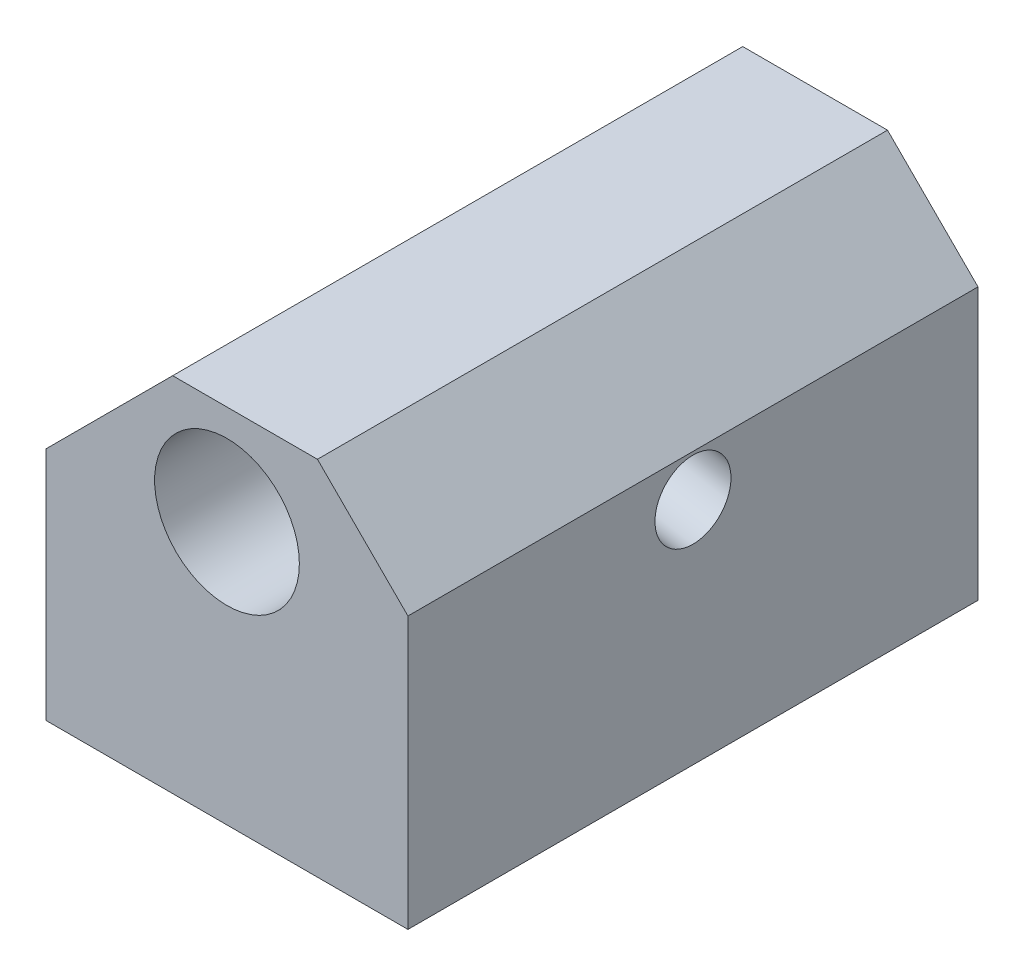
ISO-10303-21;
HEADER;
FILE_DESCRIPTION(('STEP AP214'),'2;1');
FILE_NAME('part.step','',(''),(''),'','','');
FILE_SCHEMA(('AUTOMOTIVE_DESIGN { 1 0 10303 214 1 1 1 1 }'));
ENDSEC;
DATA;
#1=APPLICATION_CONTEXT('core data for automotive mechanical design processes');
#2=APPLICATION_PROTOCOL_DEFINITION('international standard','automotive_design',2000,#1);
#3=PRODUCT_CONTEXT('',#1,'mechanical');
#4=PRODUCT('Part','Part','',(#3));
#5=PRODUCT_RELATED_PRODUCT_CATEGORY('part','',(#4));
#6=PRODUCT_DEFINITION_FORMATION('','',#4);
#7=PRODUCT_DEFINITION_CONTEXT('part definition',#1,'design');
#8=PRODUCT_DEFINITION('design','',#6,#7);
#9=PRODUCT_DEFINITION_SHAPE('','',#8);
#10=(LENGTH_UNIT() NAMED_UNIT(*) SI_UNIT(.MILLI.,.METRE.));
#11=(NAMED_UNIT(*) PLANE_ANGLE_UNIT() SI_UNIT($,.RADIAN.));
#12=(NAMED_UNIT(*) SI_UNIT($,.STERADIAN.) SOLID_ANGLE_UNIT());
#13=UNCERTAINTY_MEASURE_WITH_UNIT(LENGTH_MEASURE(1.E-05),#10,'distance_accuracy_value','');
#14=(GEOMETRIC_REPRESENTATION_CONTEXT(3) GLOBAL_UNCERTAINTY_ASSIGNED_CONTEXT((#13)) GLOBAL_UNIT_ASSIGNED_CONTEXT((#10,
#11,#12)) REPRESENTATION_CONTEXT('',''));
#15=CARTESIAN_POINT('',(0.,0.,0.));
#16=DIRECTION('',(0.,0.,1.));
#17=DIRECTION('',(1.,0.,0.));
#18=AXIS2_PLACEMENT_3D('',#15,#16,#17);
#19=CARTESIAN_POINT('',(0.,0.,15.75));
#20=DIRECTION('',(0.,0.,-1.));
#21=DIRECTION('',(-1.,0.,0.));
#22=AXIS2_PLACEMENT_3D('',#19,#20,#21);
#23=PLANE('',#22);
#24=DIRECTION('',(-0.707106781186551,-0.707106781186544,0.));
#25=VECTOR('',#24,1.);
#26=CARTESIAN_POINT('',(-2.99999999999993,10.,15.75));
#27=LINE('',#26,#25);
#28=CARTESIAN_POINT('',(-2.99999999999993,10.,15.75));
#29=VERTEX_POINT('',#28);
#30=CARTESIAN_POINT('',(-10.,3.,15.75));
#31=VERTEX_POINT('',#30);
#32=EDGE_CURVE('E151',#29,#31,#27,.T.);
#33=ORIENTED_EDGE('',*,*,#32,.T.);
#34=DIRECTION('',(0.,-1.,0.));
#35=VECTOR('',#34,1.);
#36=CARTESIAN_POINT('',(-10.,3.,15.75));
#37=LINE('',#36,#35);
#38=CARTESIAN_POINT('',(-10.,-10.,15.75));
#39=VERTEX_POINT('',#38);
#40=EDGE_CURVE('E102',#31,#39,#37,.T.);
#41=ORIENTED_EDGE('',*,*,#40,.T.);
#42=DIRECTION('',(1.,0.,0.));
#43=VECTOR('',#42,1.);
#44=CARTESIAN_POINT('',(10.,-10.,15.75));
#45=LINE('',#44,#43);
#46=CARTESIAN_POINT('',(10.,-10.,15.75));
#47=VERTEX_POINT('',#46);
#48=EDGE_CURVE('E118',#39,#47,#45,.T.);
#49=ORIENTED_EDGE('',*,*,#48,.T.);
#50=DIRECTION('',(0.,1.,0.));
#51=VECTOR('',#50,1.);
#52=CARTESIAN_POINT('',(10.,5.,15.75));
#53=LINE('',#52,#51);
#54=CARTESIAN_POINT('',(10.,5.,15.75));
#55=VERTEX_POINT('',#54);
#56=EDGE_CURVE('E111',#47,#55,#53,.T.);
#57=ORIENTED_EDGE('',*,*,#56,.T.);
#58=DIRECTION('',(-0.707106781186544,0.707106781186551,0.));
#59=VECTOR('',#58,1.);
#60=CARTESIAN_POINT('',(10.,5.,15.75));
#61=LINE('',#60,#59);
#62=CARTESIAN_POINT('',(5.00000000000006,10.,15.75));
#63=VERTEX_POINT('',#62);
#64=EDGE_CURVE('E115',#55,#63,#61,.T.);
#65=ORIENTED_EDGE('',*,*,#64,.T.);
#66=DIRECTION('',(-1.,0.,0.));
#67=VECTOR('',#66,1.);
#68=CARTESIAN_POINT('',(5.00000000000006,10.,15.75));
#69=LINE('',#68,#67);
#70=EDGE_CURVE('E66',#63,#29,#69,.T.);
#71=ORIENTED_EDGE('',*,*,#70,.T.);
#72=EDGE_LOOP('',(#33,#41,#49,#57,#65,#71));
#73=FACE_BOUND('',#72,.T.);
#74=CARTESIAN_POINT('',(0.,4.5,15.75));
#75=DIRECTION('',(0.,0.,1.));
#76=DIRECTION('',(1.,0.,0.));
#77=AXIS2_PLACEMENT_3D('',#74,#75,#76);
#78=CIRCLE('',#77,4.);
#79=CARTESIAN_POINT('',(4.,4.5,15.75));
#80=VERTEX_POINT('',#79);
#81=EDGE_CURVE('E143',#80,#80,#78,.T.);
#82=ORIENTED_EDGE('',*,*,#81,.F.);
#83=EDGE_LOOP('',(#82));
#84=FACE_BOUND('',#83,.T.);
#85=ADVANCED_FACE('F40',(#73,#84),#23,.F.);
#86=CARTESIAN_POINT('',(0.,0.,-15.75));
#87=DIRECTION('',(0.,0.,-1.));
#88=DIRECTION('',(-1.,0.,0.));
#89=AXIS2_PLACEMENT_3D('',#86,#87,#88);
#90=PLANE('',#89);
#91=DIRECTION('',(-0.707106781186551,-0.707106781186544,0.));
#92=VECTOR('',#91,1.);
#93=CARTESIAN_POINT('',(-2.99999999999993,10.,-15.75));
#94=LINE('',#93,#92);
#95=CARTESIAN_POINT('',(-2.99999999999993,10.,-15.75));
#96=VERTEX_POINT('',#95);
#97=CARTESIAN_POINT('',(-10.,3.,-15.75));
#98=VERTEX_POINT('',#97);
#99=EDGE_CURVE('E139',#96,#98,#94,.T.);
#100=ORIENTED_EDGE('',*,*,#99,.F.);
#101=DIRECTION('',(-1.,0.,0.));
#102=VECTOR('',#101,1.);
#103=CARTESIAN_POINT('',(5.00000000000006,10.,-15.75));
#104=LINE('',#103,#102);
#105=CARTESIAN_POINT('',(5.00000000000006,10.,-15.75));
#106=VERTEX_POINT('',#105);
#107=EDGE_CURVE('E93',#106,#96,#104,.T.);
#108=ORIENTED_EDGE('',*,*,#107,.F.);
#109=DIRECTION('',(-0.707106781186544,0.707106781186551,0.));
#110=VECTOR('',#109,1.);
#111=CARTESIAN_POINT('',(10.,5.,-15.75));
#112=LINE('',#111,#110);
#113=CARTESIAN_POINT('',(10.,5.,-15.75));
#114=VERTEX_POINT('',#113);
#115=EDGE_CURVE('E148',#114,#106,#112,.T.);
#116=ORIENTED_EDGE('',*,*,#115,.F.);
#117=DIRECTION('',(0.,1.,0.));
#118=VECTOR('',#117,1.);
#119=CARTESIAN_POINT('',(10.,5.,-15.75));
#120=LINE('',#119,#118);
#121=CARTESIAN_POINT('',(10.,-10.,-15.75));
#122=VERTEX_POINT('',#121);
#123=EDGE_CURVE('E127',#122,#114,#120,.T.);
#124=ORIENTED_EDGE('',*,*,#123,.F.);
#125=DIRECTION('',(1.,0.,0.));
#126=VECTOR('',#125,1.);
#127=CARTESIAN_POINT('',(10.,-10.,-15.75));
#128=LINE('',#127,#126);
#129=CARTESIAN_POINT('',(-10.,-10.,-15.75));
#130=VERTEX_POINT('',#129);
#131=EDGE_CURVE('E145',#130,#122,#128,.T.);
#132=ORIENTED_EDGE('',*,*,#131,.F.);
#133=DIRECTION('',(0.,-1.,0.));
#134=VECTOR('',#133,1.);
#135=CARTESIAN_POINT('',(-10.,3.,-15.75));
#136=LINE('',#135,#134);
#137=EDGE_CURVE('E142',#98,#130,#136,.T.);
#138=ORIENTED_EDGE('',*,*,#137,.F.);
#139=EDGE_LOOP('',(#100,#108,#116,#124,#132,#138));
#140=FACE_BOUND('',#139,.T.);
#141=CARTESIAN_POINT('',(0.,4.5,-15.75));
#142=DIRECTION('',(0.,0.,1.));
#143=DIRECTION('',(1.,0.,0.));
#144=AXIS2_PLACEMENT_3D('',#141,#142,#143);
#145=CIRCLE('',#144,4.);
#146=CARTESIAN_POINT('',(4.,4.5,-15.75));
#147=VERTEX_POINT('',#146);
#148=EDGE_CURVE('E202',#147,#147,#145,.T.);
#149=ORIENTED_EDGE('',*,*,#148,.T.);
#150=EDGE_LOOP('',(#149));
#151=FACE_BOUND('',#150,.T.);
#152=ADVANCED_FACE('F230',(#140,#151),#90,.T.);
#153=CARTESIAN_POINT('',(-2.99999999999993,10.,15.75));
#154=DIRECTION('',(0.707106781186544,-0.707106781186551,0.));
#155=DIRECTION('',(0.707106781186551,0.707106781186544,0.));
#156=AXIS2_PLACEMENT_3D('',#153,#154,#155);
#157=PLANE('',#156);
#158=ORIENTED_EDGE('',*,*,#99,.T.);
#159=DIRECTION('',(0.,0.,-1.));
#160=VECTOR('',#159,1.);
#161=CARTESIAN_POINT('',(-10.,3.,15.75));
#162=LINE('',#161,#160);
#163=EDGE_CURVE('E158',#31,#98,#162,.T.);
#164=ORIENTED_EDGE('',*,*,#163,.F.);
#165=ORIENTED_EDGE('',*,*,#32,.F.);
#166=DIRECTION('',(0.,0.,-1.));
#167=VECTOR('',#166,1.);
#168=CARTESIAN_POINT('',(-2.99999999999993,10.,15.75));
#169=LINE('',#168,#167);
#170=EDGE_CURVE('E135',#29,#96,#169,.T.);
#171=ORIENTED_EDGE('',*,*,#170,.T.);
#172=EDGE_LOOP('',(#158,#164,#165,#171));
#173=FACE_BOUND('',#172,.T.);
#174=ADVANCED_FACE('F42',(#173),#157,.F.);
#175=CARTESIAN_POINT('',(-10.,3.,15.75));
#176=DIRECTION('',(1.,0.,0.));
#177=DIRECTION('',(0.,1.,0.));
#178=AXIS2_PLACEMENT_3D('',#175,#176,#177);
#179=PLANE('',#178);
#180=ORIENTED_EDGE('',*,*,#137,.T.);
#181=DIRECTION('',(0.,0.,-1.));
#182=VECTOR('',#181,1.);
#183=CARTESIAN_POINT('',(-10.,-10.,15.75));
#184=LINE('',#183,#182);
#185=EDGE_CURVE('E155',#39,#130,#184,.T.);
#186=ORIENTED_EDGE('',*,*,#185,.F.);
#187=ORIENTED_EDGE('',*,*,#40,.F.);
#188=ORIENTED_EDGE('',*,*,#163,.T.);
#189=EDGE_LOOP('',(#180,#186,#187,#188));
#190=FACE_BOUND('',#189,.T.);
#191=ADVANCED_FACE('F224',(#190),#179,.F.);
#192=CARTESIAN_POINT('',(10.,-10.,15.75));
#193=DIRECTION('',(0.,1.,0.));
#194=DIRECTION('',(0.,0.,1.));
#195=AXIS2_PLACEMENT_3D('',#192,#193,#194);
#196=PLANE('',#195);
#197=CARTESIAN_POINT('',(0.,-10.,0.));
#198=DIRECTION('',(0.,-1.,0.));
#199=DIRECTION('',(0.,0.,-1.));
#200=AXIS2_PLACEMENT_3D('',#197,#198,#199);
#201=CIRCLE('',#200,4.25);
#202=CARTESIAN_POINT('',(0.,-10.,-4.25));
#203=VERTEX_POINT('',#202);
#204=EDGE_CURVE('E203',#203,#203,#201,.T.);
#205=ORIENTED_EDGE('',*,*,#204,.F.);
#206=EDGE_LOOP('',(#205));
#207=FACE_BOUND('',#206,.T.);
#208=ORIENTED_EDGE('',*,*,#131,.T.);
#209=DIRECTION('',(0.,0.,-1.));
#210=VECTOR('',#209,1.);
#211=CARTESIAN_POINT('',(10.,-10.,15.75));
#212=LINE('',#211,#210);
#213=EDGE_CURVE('E130',#47,#122,#212,.T.);
#214=ORIENTED_EDGE('',*,*,#213,.F.);
#215=ORIENTED_EDGE('',*,*,#48,.F.);
#216=ORIENTED_EDGE('',*,*,#185,.T.);
#217=EDGE_LOOP('',(#208,#214,#215,#216));
#218=FACE_BOUND('',#217,.T.);
#219=ADVANCED_FACE('F227',(#207,#218),#196,.F.);
#220=CARTESIAN_POINT('',(10.,5.,15.75));
#221=DIRECTION('',(-1.,0.,0.));
#222=DIRECTION('',(0.,-1.,0.));
#223=AXIS2_PLACEMENT_3D('',#220,#221,#222);
#224=PLANE('',#223);
#225=CARTESIAN_POINT('',(10.,2.69283264857183,0.));
#226=DIRECTION('',(-1.,0.,0.));
#227=DIRECTION('',(0.,-1.,0.));
#228=AXIS2_PLACEMENT_3D('',#225,#226,#227);
#229=ELLIPSE('',#228,2.13239588496007,2.1);
#230=CARTESIAN_POINT('',(10.,0.560436763611763,0.));
#231=VERTEX_POINT('',#230);
#232=EDGE_CURVE('E208',#231,#231,#229,.T.);
#233=ORIENTED_EDGE('',*,*,#232,.T.);
#234=EDGE_LOOP('',(#233));
#235=FACE_BOUND('',#234,.T.);
#236=ORIENTED_EDGE('',*,*,#123,.T.);
#237=DIRECTION('',(0.,0.,-1.));
#238=VECTOR('',#237,1.);
#239=CARTESIAN_POINT('',(10.,5.,15.75));
#240=LINE('',#239,#238);
#241=EDGE_CURVE('E124',#55,#114,#240,.T.);
#242=ORIENTED_EDGE('',*,*,#241,.F.);
#243=ORIENTED_EDGE('',*,*,#56,.F.);
#244=ORIENTED_EDGE('',*,*,#213,.T.);
#245=EDGE_LOOP('',(#236,#242,#243,#244));
#246=FACE_BOUND('',#245,.T.);
#247=ADVANCED_FACE('F125',(#235,#246),#224,.F.);
#248=CARTESIAN_POINT('',(10.,5.,15.75));
#249=DIRECTION('',(-0.707106781186551,-0.707106781186544,0.));
#250=DIRECTION('',(0.707106781186544,-0.707106781186551,0.));
#251=AXIS2_PLACEMENT_3D('',#248,#249,#250);
#252=PLANE('',#251);
#253=ORIENTED_EDGE('',*,*,#115,.T.);
#254=DIRECTION('',(0.,0.,-1.));
#255=VECTOR('',#254,1.);
#256=CARTESIAN_POINT('',(5.00000000000006,10.,15.75));
#257=LINE('',#256,#255);
#258=EDGE_CURVE('E131',#63,#106,#257,.T.);
#259=ORIENTED_EDGE('',*,*,#258,.F.);
#260=ORIENTED_EDGE('',*,*,#64,.F.);
#261=ORIENTED_EDGE('',*,*,#241,.T.);
#262=EDGE_LOOP('',(#253,#259,#260,#261));
#263=FACE_BOUND('',#262,.T.);
#264=ADVANCED_FACE('F133',(#263),#252,.F.);
#265=CARTESIAN_POINT('',(5.00000000000006,10.,15.75));
#266=DIRECTION('',(0.,-1.,0.));
#267=DIRECTION('',(1.,0.,0.));
#268=AXIS2_PLACEMENT_3D('',#265,#266,#267);
#269=PLANE('',#268);
#270=ORIENTED_EDGE('',*,*,#107,.T.);
#271=ORIENTED_EDGE('',*,*,#170,.F.);
#272=ORIENTED_EDGE('',*,*,#70,.F.);
#273=ORIENTED_EDGE('',*,*,#258,.T.);
#274=EDGE_LOOP('',(#270,#271,#272,#273));
#275=FACE_BOUND('',#274,.T.);
#276=ADVANCED_FACE('F232',(#275),#269,.F.);
#277=CARTESIAN_POINT('',(0.,4.5,15.75));
#278=DIRECTION('',(0.,0.,-1.));
#279=DIRECTION('',(-1.,0.,0.));
#280=AXIS2_PLACEMENT_3D('',#277,#278,#279);
#281=CYLINDRICAL_SURFACE('',#280,4.);
#282=CARTESIAN_POINT('',(3.73573382421497,5.92978767466228,0.));
#283=CARTESIAN_POINT('',(3.73574388882922,5.92977635725523,-0.10900487248513));
#284=CARTESIAN_POINT('',(3.73933920981242,5.92047562433933,-0.218131042316769));
#285=CARTESIAN_POINT('',(3.75303986475567,5.88385240616574,-0.432980813605728));
#286=CARTESIAN_POINT('',(3.76315734967283,5.85649628098081,-0.53869767663652));
#287=CARTESIAN_POINT('',(3.78798394174231,5.78552290822274,-0.743225340281333));
#288=CARTESIAN_POINT('',(3.80266751129794,5.74199584553236,-0.842070898971087));
#289=CARTESIAN_POINT('',(3.83432873328278,5.64050039960012,-1.03158235918548));
#290=CARTESIAN_POINT('',(3.85130669428291,5.58253007300877,-1.12224715774618));
#291=CARTESIAN_POINT('',(3.88666506630928,5.44819044934738,-1.30160928697176));
#292=CARTESIAN_POINT('',(3.90503753060019,5.37065156023718,-1.38943267267201));
#293=CARTESIAN_POINT('',(3.9387672724276,5.20247469598594,-1.55224901996635));
#294=CARTESIAN_POINT('',(3.95412300572651,5.11183005312481,-1.62723540790363));
#295=CARTESIAN_POINT('',(3.97999990573105,4.91273679803611,-1.7673634284533));
#296=CARTESIAN_POINT('',(3.99010934030686,4.80348748803581,-1.83145411576367));
#297=CARTESIAN_POINT('',(4.0009138638704,4.57539007127553,-1.94052378148518));
#298=CARTESIAN_POINT('',(4.00161568200528,4.45654888668,-1.98551639819159));
#299=CARTESIAN_POINT('',(3.9919619407152,4.22281545469177,-2.05148193373954));
#300=CARTESIAN_POINT('',(3.98246809233367,4.10834290397449,-2.07406009301153));
#301=CARTESIAN_POINT('',(3.95312612574611,3.87857050282372,-2.0999222240196));
#302=CARTESIAN_POINT('',(3.93328457969918,3.76327122326166,-2.10321842613824));
#303=CARTESIAN_POINT('',(3.8861052638642,3.54638842558353,-2.09100911539977));
#304=CARTESIAN_POINT('',(3.85962209562948,3.44451694638769,-2.0772005783596));
#305=CARTESIAN_POINT('',(3.79982004842026,3.24616582917178,-2.03428448793197));
#306=CARTESIAN_POINT('',(3.76650054527618,3.14968668450565,-2.00517553721013));
#307=CARTESIAN_POINT('',(3.694156102428,2.9626489147776,-1.93222637269289));
#308=CARTESIAN_POINT('',(3.65504265012272,2.87222114441992,-1.88814068086587));
#309=CARTESIAN_POINT('',(3.57369366485427,2.70062678739403,-1.78683082634314));
#310=CARTESIAN_POINT('',(3.53145703738273,2.61946347301885,-1.72960204274877));
#311=CARTESIAN_POINT('',(3.44170338226362,2.45942497261562,-1.59680430831566));
#312=CARTESIAN_POINT('',(3.39409499294296,2.38167090077285,-1.51994519803714));
#313=CARTESIAN_POINT('',(3.30110872526266,2.23948824620547,-1.35347241778113));
#314=CARTESIAN_POINT('',(3.25573299232802,2.17507229691932,-1.26384679013622));
#315=CARTESIAN_POINT('',(3.16760712533176,2.05620353076697,-1.06620551177198));
#316=CARTESIAN_POINT('',(3.12530709411419,2.00285600999866,-0.957315836829489));
#317=CARTESIAN_POINT('',(3.05227115275024,1.91408123949603,-0.728881038594662));
#318=CARTESIAN_POINT('',(3.021521057204,1.87863198891366,-0.609349210574807));
#319=CARTESIAN_POINT('',(2.97806517019922,1.82939571742376,-0.373915912940019));
#320=CARTESIAN_POINT('',(2.96401942002301,1.81398891697369,-0.258607203624979));
#321=CARTESIAN_POINT('',(2.951455358101,1.80018170291955,-0.0261777025889804));
#322=CARTESIAN_POINT('',(2.95292276124122,1.801765643601,0.0909413228832848));
#323=CARTESIAN_POINT('',(2.9698859587365,1.82046992711117,0.307152153482557));
#324=CARTESIAN_POINT('',(2.98350890061147,1.83551680588273,0.406586850178257));
#325=CARTESIAN_POINT('',(3.020668976319,1.87772161239194,0.600920219354124));
#326=CARTESIAN_POINT('',(3.04420992937658,1.9048842058825,0.69581712873268));
#327=CARTESIAN_POINT('',(3.10030524386941,1.97213459357223,0.883627217890509));
#328=CARTESIAN_POINT('',(3.13323978736668,2.01278292992207,0.976223608159363));
#329=CARTESIAN_POINT('',(3.20481504670472,2.10571515773543,1.15298164240043));
#330=CARTESIAN_POINT('',(3.24345870541864,2.15800505715592,1.23713889847494));
#331=CARTESIAN_POINT('',(3.32981375287527,2.28214896594857,1.40770296531066));
#332=CARTESIAN_POINT('',(3.37801988223844,2.35575452641615,1.49259140491386));
#333=CARTESIAN_POINT('',(3.47488071800792,2.51656411741067,1.64813613911597));
#334=CARTESIAN_POINT('',(3.5235356352092,2.60377488007912,1.71878534796223));
#335=CARTESIAN_POINT('',(3.61987222101468,2.79459461842828,1.8465432114591));
#336=CARTESIAN_POINT('',(3.66742611166257,2.89874039744041,1.90295440850277));
#337=CARTESIAN_POINT('',(3.75563369323199,3.11827733149894,1.99570241904227));
#338=CARTESIAN_POINT('',(3.79629405935876,3.23365743554907,2.03205873007556));
#339=CARTESIAN_POINT('',(3.86418672560047,3.46044161026922,2.08018253789637));
#340=CARTESIAN_POINT('',(3.89234287138805,3.5711326720768,2.09400545342962));
#341=CARTESIAN_POINT('',(3.9390840835918,3.79523583024272,2.10285214449908));
#342=CARTESIAN_POINT('',(3.95767358924312,3.90864663893275,2.09788464835541));
#343=CARTESIAN_POINT('',(3.98376400965127,4.12509824222281,2.07056684593317));
#344=CARTESIAN_POINT('',(3.99204258939678,4.22823347392377,2.04966041653997));
#345=CARTESIAN_POINT('',(4.00068347945213,4.43069470076948,1.99309022230328));
#346=CARTESIAN_POINT('',(4.00104484383502,4.53002023932747,1.95742469460231));
#347=CARTESIAN_POINT('',(3.99486213031366,4.72587780408664,1.87110898168503));
#348=CARTESIAN_POINT('',(3.98807340051486,4.82218682855579,1.81997349015483));
#349=CARTESIAN_POINT('',(3.9689309548596,5.00611366199099,1.70476947567042));
#350=CARTESIAN_POINT('',(3.9565748505942,5.09372772110339,1.64069540857203));
#351=CARTESIAN_POINT('',(3.92680764719066,5.26728577319698,1.49363061850587));
#352=CARTESIAN_POINT('',(3.90900074119554,5.35207814900283,1.40935727944421));
#353=CARTESIAN_POINT('',(3.87200466880851,5.50694170863506,1.22836684135043));
#354=CARTESIAN_POINT('',(3.85281412396071,5.57699793161271,1.13163725518586));
#355=CARTESIAN_POINT('',(3.81538018344913,5.70309151254874,0.922370907309671));
#356=CARTESIAN_POINT('',(3.79722882566375,5.75827705843025,0.809292849807942));
#357=CARTESIAN_POINT('',(3.77434931765566,5.82469936809198,0.63324869119763));
#358=CARTESIAN_POINT('',(3.76745133012323,5.84410479535718,0.573548335378771));
#359=CARTESIAN_POINT('',(3.75548200773901,5.87719526060027,0.452417996539227));
#360=CARTESIAN_POINT('',(3.75040948659348,5.89088401453505,0.39098916487277));
#361=CARTESIAN_POINT('',(3.74291100002645,5.91092789324483,0.274750482297567));
#362=CARTESIAN_POINT('',(3.74023274376832,5.9179879051628,0.22007773519887));
#363=CARTESIAN_POINT('',(3.73664156841135,5.92742076836415,0.110280357905016));
#364=CARTESIAN_POINT('',(3.73572873159022,5.92979340119147,0.0551557067690171));
#365=CARTESIAN_POINT('',(3.73573382421497,5.92978767466228,0.));
#366=B_SPLINE_CURVE_WITH_KNOTS('',3,(#282,#283,#284,#285,#286,#287,#288,#289,#290,#291,#292,
#293,#294,#295,#296,#297,#298,#299,#300,#301,#302,#303,#304,#305,#306,#307,#308,#309,#310,#311,
#312,#313,#314,#315,#316,#317,#318,#319,#320,#321,#322,#323,#324,#325,#326,#327,#328,#329,#330,
#331,#332,#333,#334,#335,#336,#337,#338,#339,#340,#341,#342,#343,#344,#345,#346,#347,#348,#349,
#350,#351,#352,#353,#354,#355,#356,#357,#358,#359,#360,#361,#362,#363,#364,#365),.UNSPECIFIED.,
.T.,.F.,(4,2,2,2,2,2,2,2,2,2,2,2,2,2,2,2,2,2,2,2,2,2,2,2,2,2,2,2,2,2,2,2,2,2,2,2,2,2,2,2,2,4),
(0.,0.326791523596936,0.654193634528532,0.979796591858559,1.30544338293594,1.65972345746273,
2.01418441493588,2.39335959943495,2.77226355031262,3.12149166757548,3.47049824835422,
3.78748987929336,4.10451046502358,4.42700024421397,4.7496035796477,5.10584652082891,
5.46242535572385,5.84566981000256,6.22844201993997,6.57782700869907,6.92689029823773,
7.22998530854011,7.5331971414191,7.8510429895248,8.16905325275698,8.53424010139829,
8.89960822874656,9.28039922364491,9.66081935474374,10.0040697601162,10.3471607420823,
10.6623995301666,10.977675981902,11.3041016838807,11.6306675563245,11.9916903212788,
12.3530778634201,12.7321159612543,12.9213211927067,13.1104032446597,13.275749775207,
13.4411040115744),.UNSPECIFIED.);
#367=CARTESIAN_POINT('',(3.75419889698741,3.11942380077792,1.99210708594154));
#368=VERTEX_POINT('',#367);
#369=CARTESIAN_POINT('',(3.75419889698742,3.11942380077792,-1.99210708594154));
#370=VERTEX_POINT('',#369);
#371=EDGE_CURVE('E11',#368,#370,#366,.T.);
#372=ORIENTED_EDGE('',*,*,#371,.F.);
#373=CARTESIAN_POINT('',(-3.96862696659689,5.,1.52069063257455));
#374=CARTESIAN_POINT('',(-3.97354304586204,4.96097381810533,1.50786136152258));
#375=CARTESIAN_POINT('',(-3.977932886008,4.92148596438851,1.49621923641095));
#376=CARTESIAN_POINT('',(-3.98558676219901,4.84163580315582,1.47570855649782));
#377=CARTESIAN_POINT('',(-3.98884924334194,4.80127236885029,1.46684383396861));
#378=CARTESIAN_POINT('',(-3.99676875368411,4.67984636740227,1.44519732127154));
#379=CARTESIAN_POINT('',(-3.99965011887754,4.5977331499862,1.43711480112112));
#380=CARTESIAN_POINT('',(-4.00029181299223,4.43275423673456,1.43532825301997));
#381=CARTESIAN_POINT('',(-3.99801510797099,4.34988738089606,1.44172820602381));
#382=CARTESIAN_POINT('',(-3.98854747270871,4.18662780570009,1.46770784412369));
#383=CARTESIAN_POINT('',(-3.98135389875695,4.10623644168292,1.48729461944842));
#384=CARTESIAN_POINT('',(-3.95720348824089,3.90306012274173,1.55071483260326));
#385=CARTESIAN_POINT('',(-3.93699424981176,3.78309244667518,1.60203211253694));
#386=CARTESIAN_POINT('',(-3.88772763163925,3.55145605268259,1.71816787082274));
#387=CARTESIAN_POINT('',(-3.85861468469421,3.43984509514413,1.78307030625666));
#388=CARTESIAN_POINT('',(-3.78878199865306,3.2112234195852,1.92737435010536));
#389=CARTESIAN_POINT('',(-3.74712433070059,3.09502024660309,2.00758568017899));
#390=CARTESIAN_POINT('',(-3.65444569719787,2.86906784578287,2.17173976787611));
#391=CARTESIAN_POINT('',(-3.6034151909188,2.75932534603108,2.25568626098704));
#392=CARTESIAN_POINT('',(-3.49205846568342,2.54550840564099,2.42451176720586));
#393=CARTESIAN_POINT('',(-3.43173624880684,2.44143155072153,2.50939036429385));
#394=CARTESIAN_POINT('',(-3.30165189473649,2.23867445568565,2.67823761984924));
#395=CARTESIAN_POINT('',(-3.23189442400748,2.13999158149155,2.76220670610606));
#396=CARTESIAN_POINT('',(-3.08962668997358,1.95710092956709,2.92008857269301));
#397=CARTESIAN_POINT('',(-3.01798145579123,1.87240188962165,2.99420832194827));
#398=CARTESIAN_POINT('',(-2.86652944700425,1.70795500053687,3.13951252599785));
#399=CARTESIAN_POINT('',(-2.78672155041677,1.62820783447532,3.21069657537925));
#400=CARTESIAN_POINT('',(-2.53503024251524,1.39753094104462,3.41807639266074));
#401=CARTESIAN_POINT('',(-2.35049335092218,1.25466047324422,3.54854244100856));
#402=CARTESIAN_POINT('',(-2.00018050647842,1.03150876793698,3.75387669272813));
#403=CARTESIAN_POINT('',(-1.84196375858493,0.944606694526363,3.83438677769595));
#404=CARTESIAN_POINT('',(-1.59194860411325,0.829285838446407,3.94162948021151));
#405=CARTESIAN_POINT('',(-1.50646609770759,0.79334191885586,3.97513178567251));
#406=CARTESIAN_POINT('',(-1.33161898939826,0.727000799786437,4.03706348445111));
#407=CARTESIAN_POINT('',(-1.24225611464601,0.696601163253273,4.06549510652463));
#408=CARTESIAN_POINT('',(-1.05920763113708,0.641593206094736,4.11700240412601));
#409=CARTESIAN_POINT('',(-0.965487797007023,0.617045672995296,4.14002183033811));
#410=CARTESIAN_POINT('',(-0.775290718903061,0.574645280586653,4.17981531737301));
#411=CARTESIAN_POINT('',(-0.678814988023234,0.556788820860285,4.19659273693881));
#412=CARTESIAN_POINT('',(-0.483953068228635,0.528164086671947,4.223500521622));
#413=CARTESIAN_POINT('',(-0.385567990157397,0.517391810855141,4.23363463906094));
#414=CARTESIAN_POINT('',(-0.1878105215711,0.503182327401976,4.24700431582164));
#415=CARTESIAN_POINT('',(-0.0884382842245292,0.499743999146154,4.2502409290747));
#416=CARTESIAN_POINT('',(0.0960823380158941,0.500247106315385,4.24976744042028));
#417=CARTESIAN_POINT('',(0.181237731559154,0.503205832175325,4.24698238117385));
#418=CARTESIAN_POINT('',(0.350879177096289,0.514510559449824,4.23634548027923));
#419=CARTESIAN_POINT('',(0.435365015611604,0.522858214217112,4.22849208363774));
#420=CARTESIAN_POINT('',(0.686812573375991,0.555793695328166,4.19752338346075));
#421=CARTESIAN_POINT('',(0.85193878092647,0.588274924137043,4.16699870271484));
#422=CARTESIAN_POINT('',(1.17045661137207,0.671575220511052,4.08890340963282));
#423=CARTESIAN_POINT('',(1.32397993432288,0.722131785382384,4.04157687132378));
#424=CARTESIAN_POINT('',(1.61938662043091,0.839011223129891,3.93254335188154));
#425=CARTESIAN_POINT('',(1.76126698197661,0.905338144610415,3.8708326780982));
#426=CARTESIAN_POINT('',(2.09566906535834,1.08543517663311,3.70406548510811));
#427=CARTESIAN_POINT('',(2.28070432446411,1.20686158523893,3.59225884484247));
#428=CARTESIAN_POINT('',(2.62210615430781,1.47155232097672,3.35125974420092));
#429=CARTESIAN_POINT('',(2.77837809562941,1.61488598761558,3.22201223880083));
#430=CARTESIAN_POINT('',(3.01399570331329,1.86664727253549,2.99915090570319));
#431=CARTESIAN_POINT('',(3.10138923990572,1.97028434245371,2.90843719125072));
#432=CARTESIAN_POINT('',(3.26434983168532,2.18437087173977,2.72426784831242));
#433=CARTESIAN_POINT('',(3.33990953941884,2.29482450455707,2.63081055879932));
#434=CARTESIAN_POINT('',(3.47929116854544,2.5220544418376,2.44348759692863));
#435=CARTESIAN_POINT('',(3.54313806734739,2.63881658810637,2.34962324102761));
#436=CARTESIAN_POINT('',(3.65942999297165,2.87937162925515,2.16402422482042));
#437=CARTESIAN_POINT('',(3.71188564862025,3.00315783295693,2.07228765116952));
#438=CARTESIAN_POINT('',(3.79230223241056,3.22400876218981,1.91994449330179));
#439=CARTESIAN_POINT('',(3.82302274718699,3.31897200778252,1.85775626938089));
#440=CARTESIAN_POINT('',(3.87810989513321,3.51479715543662,1.739820136909));
#441=CARTESIAN_POINT('',(3.90247336255498,3.61566196592862,1.68407544484159));
#442=CARTESIAN_POINT('',(3.9408681774734,3.8088208304521,1.59190649717009));
#443=CARTESIAN_POINT('',(3.95590511462077,3.90010222255095,1.55383509934117));
#444=CARTESIAN_POINT('',(3.97982898786619,4.08790716990916,1.4915095450532));
#445=CARTESIAN_POINT('',(3.98874330804522,4.18440527330067,1.46719395154355));
#446=CARTESIAN_POINT('',(3.99838255282499,4.36150826989494,1.4406961344055));
#447=CARTESIAN_POINT('',(4.00037158061636,4.44151444803222,1.435106028715));
#448=CARTESIAN_POINT('',(3.99951308451649,4.60144289168496,1.43749650959211));
#449=CARTESIAN_POINT('',(3.99665815572073,4.68136484150564,1.44549787331474));
#450=CARTESIAN_POINT('',(3.98888427961589,4.80082709277733,1.4667488900769));
#451=CARTESIAN_POINT('',(3.98561372157508,4.8413374396492,1.47563616008011));
#452=CARTESIAN_POINT('',(3.97794421745604,4.92138466776325,1.49618902643663));
#453=CARTESIAN_POINT('',(3.97354941975278,4.96092455432499,1.50784439758243));
#454=CARTESIAN_POINT('',(3.96862696659689,5.,1.52069063257455));
#455=B_SPLINE_CURVE_WITH_KNOTS('',3,(#373,#374,#375,#376,#377,#378,#379,#380,#381,#382,#383,
#384,#385,#386,#387,#388,#389,#390,#391,#392,#393,#394,#395,#396,#397,#398,#399,#400,#401,#402,
#403,#404,#405,#406,#407,#408,#409,#410,#411,#412,#413,#414,#415,#416,#417,#418,#419,#420,#421,
#422,#423,#424,#425,#426,#427,#428,#429,#430,#431,#432,#433,#434,#435,#436,#437,#438,#439,#440,
#441,#442,#443,#444,#445,#446,#447,#448,#449,#450,#451,#452,#453,#454),.UNSPECIFIED.,.F.,.F.,(4,
2,2,2,2,2,2,2,2,2,2,2,2,2,2,2,2,2,2,2,2,2,2,2,2,2,2,2,2,2,2,2,2,2,2,2,2,2,2,2,4),(0.,
0.124093487051486,0.248357452359525,0.494624368774384,0.74266503243472,0.990839168056069,
1.3847008050417,1.78107246712474,2.22208500734099,2.6635489729614,3.10482332236327,
3.54588022000374,3.94575959722865,4.34569401315043,5.14326235654375,5.73385231015478,
6.02933470973551,6.3246869118875,6.62298499220514,6.92112232924313,7.21909112460504,
7.5170143873864,7.77244108988982,8.02794619596411,8.53844008224681,9.04180279280308,
9.54529486765278,10.2851024256575,11.0273020169468,11.5160985564125,12.0051973896369,
12.4932407842329,12.9808268247284,13.3332893751988,13.6859271150488,13.9852035137031,
14.2831324931353,14.522576331063,14.7623865340987,14.8870935901463,15.011346960484),.UNSPECIFIED.);
#456=CARTESIAN_POINT('',(-3.96862696659689,5.,1.52069063257455));
#457=VERTEX_POINT('',#456);
#458=EDGE_CURVE('E52',#457,#368,#455,.T.);
#459=ORIENTED_EDGE('',*,*,#458,.F.);
#460=CARTESIAN_POINT('',(-3.9925245025954,4.74443423691328,-2.43279374579934));
#461=CARTESIAN_POINT('',(-3.99050229968687,4.77752689812045,-2.33024499621972));
#462=CARTESIAN_POINT('',(-3.98812811435129,4.80948527944734,-2.22733650947126));
#463=CARTESIAN_POINT('',(-3.9829071747738,4.87065913975489,-2.02067067774706));
#464=CARTESIAN_POINT('',(-3.98006020669868,4.89987336818901,-1.91691296896005));
#465=CARTESIAN_POINT('',(-3.97113086069363,4.98292347535929,-1.6032556412202));
#466=CARTESIAN_POINT('',(-3.96468525221043,5.03182112090419,-1.39200996609754));
#467=CARTESIAN_POINT('',(-3.95338887367749,5.11015094009211,-0.972987271234309));
#468=CARTESIAN_POINT('',(-3.94849226912459,5.14017533806656,-0.765327849397545));
#469=CARTESIAN_POINT('',(-3.94360968809357,5.16934778061769,-0.452610812559756));
#470=CARTESIAN_POINT('',(-3.94239253899805,5.17642886229336,-0.348290919321407));
#471=CARTESIAN_POINT('',(-3.94090128855751,5.18506973645101,-0.139410659187669));
#472=CARTESIAN_POINT('',(-3.94062715467608,5.18662971942482,-0.0348503007134969));
#473=CARTESIAN_POINT('',(-3.94104633408069,5.18421788191281,0.168579955607856));
#474=CARTESIAN_POINT('',(-3.94168843493396,5.18053891263581,0.267453609820837));
#475=CARTESIAN_POINT('',(-3.94377792084138,5.16831999661232,0.464896655685479));
#476=CARTESIAN_POINT('',(-3.94522540639193,5.15977944323132,0.563466007822381));
#477=CARTESIAN_POINT('',(-3.95057649539971,5.1272519393419,0.858836981065267));
#478=CARTESIAN_POINT('',(-3.95548682654168,5.09636629757924,1.05487642386673));
#479=CARTESIAN_POINT('',(-3.96642737201791,5.01865591287007,1.45025280548759));
#480=CARTESIAN_POINT('',(-3.97248886641593,4.97134454683395,1.64948901390576));
#481=CARTESIAN_POINT('',(-3.98084698793433,4.89187847450439,1.94550732517355));
#482=CARTESIAN_POINT('',(-3.98350523277357,4.86404926861039,2.04347839572946));
#483=CARTESIAN_POINT('',(-3.98838816669655,4.80596239992853,2.23867131521303));
#484=CARTESIAN_POINT('',(-3.99061301458442,4.77570563240047,2.33589342598349));
#485=CARTESIAN_POINT('',(-3.9925245025954,4.74443423691328,2.43279374579934));
#486=B_SPLINE_CURVE_WITH_KNOTS('',3,(#460,#461,#462,#463,#464,#465,#466,#467,#468,#469,#470,
#471,#472,#473,#474,#475,#476,#477,#478,#479,#480,#481,#482,#483,#484,#485),.UNSPECIFIED.,.F.,
.F.,(4,2,2,2,2,2,2,2,2,2,2,2,4),(0.,0.323312966071264,0.646772562469121,1.29697022740981,
1.92558663738294,2.23915597792365,2.5527144994253,2.84941786728165,3.14615826627151,
3.74090902379716,4.35504149869682,4.66066141550404,4.96616913637559),.UNSPECIFIED.);
#487=CARTESIAN_POINT('',(-3.96862696659689,5.,-1.52069063257455));
#488=VERTEX_POINT('',#487);
#489=EDGE_CURVE('E167',#488,#457,#486,.T.);
#490=ORIENTED_EDGE('',*,*,#489,.F.);
#491=CARTESIAN_POINT('',(3.96862696659689,5.,-1.52069063257455));
#492=CARTESIAN_POINT('',(3.97354304586204,4.96097381810533,-1.50786136152258));
#493=CARTESIAN_POINT('',(3.977932886008,4.92148596438851,-1.49621923641095));
#494=CARTESIAN_POINT('',(3.98558676219901,4.84163580315582,-1.47570855649782));
#495=CARTESIAN_POINT('',(3.98884924334194,4.80127236885029,-1.46684383396861));
#496=CARTESIAN_POINT('',(3.99676875368411,4.67984636740227,-1.44519732127154));
#497=CARTESIAN_POINT('',(3.99965011887754,4.5977331499862,-1.43711480112112));
#498=CARTESIAN_POINT('',(4.00029181299223,4.43275423673456,-1.43532825301997));
#499=CARTESIAN_POINT('',(3.99801510797099,4.34988738089606,-1.44172820602381));
#500=CARTESIAN_POINT('',(3.98854747270871,4.18662780570009,-1.46770784412369));
#501=CARTESIAN_POINT('',(3.98135389875695,4.10623644168292,-1.48729461944842));
#502=CARTESIAN_POINT('',(3.95720348824089,3.90306012274173,-1.55071483260326));
#503=CARTESIAN_POINT('',(3.93699424981176,3.78309244667518,-1.60203211253694));
#504=CARTESIAN_POINT('',(3.88772763163925,3.55145605268259,-1.71816787082274));
#505=CARTESIAN_POINT('',(3.85861468469421,3.43984509514413,-1.78307030625666));
#506=CARTESIAN_POINT('',(3.78878199865306,3.2112234195852,-1.92737435010536));
#507=CARTESIAN_POINT('',(3.74712433070059,3.09502024660309,-2.00758568017899));
#508=CARTESIAN_POINT('',(3.65444569719787,2.86906784578287,-2.17173976787611));
#509=CARTESIAN_POINT('',(3.6034151909188,2.75932534603108,-2.25568626098704));
#510=CARTESIAN_POINT('',(3.49205846568342,2.54550840564099,-2.42451176720586));
#511=CARTESIAN_POINT('',(3.43173624880684,2.44143155072153,-2.50939036429385));
#512=CARTESIAN_POINT('',(3.30165189473649,2.23867445568565,-2.67823761984924));
#513=CARTESIAN_POINT('',(3.23189442400748,2.13999158149155,-2.76220670610606));
#514=CARTESIAN_POINT('',(3.08962668997358,1.95710092956709,-2.92008857269301));
#515=CARTESIAN_POINT('',(3.01798145579123,1.87240188962165,-2.99420832194827));
#516=CARTESIAN_POINT('',(2.86652944700425,1.70795500053687,-3.13951252599785));
#517=CARTESIAN_POINT('',(2.78672155041677,1.62820783447532,-3.21069657537925));
#518=CARTESIAN_POINT('',(2.53503024251524,1.39753094104462,-3.41807639266074));
#519=CARTESIAN_POINT('',(2.35049335092218,1.25466047324422,-3.54854244100856));
#520=CARTESIAN_POINT('',(2.00018050647842,1.03150876793698,-3.75387669272813));
#521=CARTESIAN_POINT('',(1.84196375858493,0.944606694526363,-3.83438677769595));
#522=CARTESIAN_POINT('',(1.59194860411325,0.829285838446407,-3.94162948021151));
#523=CARTESIAN_POINT('',(1.50646609770759,0.79334191885586,-3.97513178567251));
#524=CARTESIAN_POINT('',(1.33161898939826,0.727000799786437,-4.03706348445111));
#525=CARTESIAN_POINT('',(1.24225611464601,0.696601163253273,-4.06549510652463));
#526=CARTESIAN_POINT('',(1.05920763113708,0.641593206094736,-4.11700240412601));
#527=CARTESIAN_POINT('',(0.965487797007023,0.617045672995296,-4.14002183033811));
#528=CARTESIAN_POINT('',(0.775290718903061,0.574645280586653,-4.17981531737301));
#529=CARTESIAN_POINT('',(0.678814988023234,0.556788820860285,-4.19659273693881));
#530=CARTESIAN_POINT('',(0.483953068228635,0.528164086671947,-4.223500521622));
#531=CARTESIAN_POINT('',(0.385567990157397,0.517391810855141,-4.23363463906094));
#532=CARTESIAN_POINT('',(0.1878105215711,0.503182327401976,-4.24700431582164));
#533=CARTESIAN_POINT('',(0.0884382842245292,0.499743999146154,-4.2502409290747));
#534=CARTESIAN_POINT('',(-0.0960823380158941,0.500247106315385,-4.24976744042028));
#535=CARTESIAN_POINT('',(-0.181237731559154,0.503205832175325,-4.24698238117385));
#536=CARTESIAN_POINT('',(-0.350879177096289,0.514510559449824,-4.23634548027923));
#537=CARTESIAN_POINT('',(-0.435365015611604,0.522858214217112,-4.22849208363774));
#538=CARTESIAN_POINT('',(-0.686812573375991,0.555793695328166,-4.19752338346075));
#539=CARTESIAN_POINT('',(-0.85193878092647,0.588274924137043,-4.16699870271484));
#540=CARTESIAN_POINT('',(-1.17045661137207,0.671575220511052,-4.08890340963282));
#541=CARTESIAN_POINT('',(-1.32397993432288,0.722131785382384,-4.04157687132378));
#542=CARTESIAN_POINT('',(-1.61938662043091,0.839011223129891,-3.93254335188154));
#543=CARTESIAN_POINT('',(-1.76126698197661,0.905338144610415,-3.8708326780982));
#544=CARTESIAN_POINT('',(-2.09566906535834,1.08543517663311,-3.70406548510811));
#545=CARTESIAN_POINT('',(-2.28070432446411,1.20686158523893,-3.59225884484247));
#546=CARTESIAN_POINT('',(-2.62210615430781,1.47155232097672,-3.35125974420092));
#547=CARTESIAN_POINT('',(-2.77837809562941,1.61488598761558,-3.22201223880083));
#548=CARTESIAN_POINT('',(-3.01399570331329,1.86664727253549,-2.99915090570319));
#549=CARTESIAN_POINT('',(-3.10138923990572,1.97028434245371,-2.90843719125072));
#550=CARTESIAN_POINT('',(-3.26434983168532,2.18437087173977,-2.72426784831242));
#551=CARTESIAN_POINT('',(-3.33990953941884,2.29482450455707,-2.63081055879932));
#552=CARTESIAN_POINT('',(-3.47929116854544,2.5220544418376,-2.44348759692863));
#553=CARTESIAN_POINT('',(-3.54313806734739,2.63881658810637,-2.34962324102761));
#554=CARTESIAN_POINT('',(-3.65942999297165,2.87937162925515,-2.16402422482042));
#555=CARTESIAN_POINT('',(-3.71188564862025,3.00315783295693,-2.07228765116952));
#556=CARTESIAN_POINT('',(-3.79230223241056,3.22400876218981,-1.91994449330179));
#557=CARTESIAN_POINT('',(-3.82302274718699,3.31897200778252,-1.85775626938089));
#558=CARTESIAN_POINT('',(-3.87810989513321,3.51479715543662,-1.739820136909));
#559=CARTESIAN_POINT('',(-3.90247336255498,3.61566196592862,-1.68407544484159));
#560=CARTESIAN_POINT('',(-3.9408681774734,3.8088208304521,-1.59190649717009));
#561=CARTESIAN_POINT('',(-3.95590511462077,3.90010222255095,-1.55383509934117));
#562=CARTESIAN_POINT('',(-3.97982898786619,4.08790716990916,-1.4915095450532));
#563=CARTESIAN_POINT('',(-3.98874330804522,4.18440527330067,-1.46719395154355));
#564=CARTESIAN_POINT('',(-3.99838255282499,4.36150826989494,-1.4406961344055));
#565=CARTESIAN_POINT('',(-4.00037158061636,4.44151444803222,-1.435106028715));
#566=CARTESIAN_POINT('',(-3.99951308451649,4.60144289168496,-1.43749650959211));
#567=CARTESIAN_POINT('',(-3.99665815572073,4.68136484150564,-1.44549787331474));
#568=CARTESIAN_POINT('',(-3.98888427961589,4.80082709277733,-1.4667488900769));
#569=CARTESIAN_POINT('',(-3.98561372157508,4.8413374396492,-1.47563616008011));
#570=CARTESIAN_POINT('',(-3.97794421745604,4.92138466776325,-1.49618902643663));
#571=CARTESIAN_POINT('',(-3.97354941975278,4.96092455432499,-1.50784439758243));
#572=CARTESIAN_POINT('',(-3.96862696659689,5.,-1.52069063257455));
#573=B_SPLINE_CURVE_WITH_KNOTS('',3,(#491,#492,#493,#494,#495,#496,#497,#498,#499,#500,#501,
#502,#503,#504,#505,#506,#507,#508,#509,#510,#511,#512,#513,#514,#515,#516,#517,#518,#519,#520,
#521,#522,#523,#524,#525,#526,#527,#528,#529,#530,#531,#532,#533,#534,#535,#536,#537,#538,#539,
#540,#541,#542,#543,#544,#545,#546,#547,#548,#549,#550,#551,#552,#553,#554,#555,#556,#557,#558,
#559,#560,#561,#562,#563,#564,#565,#566,#567,#568,#569,#570,#571,#572),.UNSPECIFIED.,.F.,.F.,(4,
2,2,2,2,2,2,2,2,2,2,2,2,2,2,2,2,2,2,2,2,2,2,2,2,2,2,2,2,2,2,2,2,2,2,2,2,2,2,2,4),(0.,
0.124093487051486,0.248357452359525,0.494624368774384,0.74266503243472,0.990839168056069,
1.3847008050417,1.78107246712474,2.22208500734099,2.6635489729614,3.10482332236327,
3.54588022000374,3.94575959722865,4.34569401315043,5.14326235654375,5.73385231015478,
6.02933470973551,6.3246869118875,6.62298499220514,6.92112232924313,7.21909112460504,
7.5170143873864,7.77244108988982,8.02794619596411,8.53844008224681,9.04180279280308,
9.54529486765278,10.2851024256575,11.0273020169468,11.5160985564125,12.0051973896369,
12.4932407842329,12.9808268247284,13.3332893751988,13.6859271150488,13.9852035137031,
14.2831324931353,14.522576331063,14.7623865340987,14.8870935901463,15.011346960484),.UNSPECIFIED.);
#574=EDGE_CURVE('E160',#370,#488,#573,.T.);
#575=ORIENTED_EDGE('',*,*,#574,.F.);
#576=EDGE_LOOP('',(#372,#459,#490,#575));
#577=FACE_BOUND('',#576,.T.);
#578=ORIENTED_EDGE('',*,*,#81,.T.);
#579=EDGE_LOOP('',(#578));
#580=FACE_BOUND('',#579,.T.);
#581=ORIENTED_EDGE('',*,*,#148,.F.);
#582=EDGE_LOOP('',(#581));
#583=FACE_BOUND('',#582,.T.);
#584=ADVANCED_FACE('F172',(#577,#580,#583),#281,.F.);
#585=CARTESIAN_POINT('',(0.,5.,0.));
#586=DIRECTION('',(0.,-1.,0.));
#587=DIRECTION('',(0.,0.,-1.));
#588=AXIS2_PLACEMENT_3D('',#585,#586,#587);
#589=CONICAL_SURFACE('',#588,4.25,1.02974425867665);
#590=ORIENTED_EDGE('',*,*,#489,.T.);
#591=CARTESIAN_POINT('',(0.,5.,0.));
#592=DIRECTION('',(0.,-1.,0.));
#593=DIRECTION('',(0.,0.,-1.));
#594=AXIS2_PLACEMENT_3D('',#591,#592,#593);
#595=CIRCLE('',#594,4.25);
#596=EDGE_CURVE('E197',#457,#488,#595,.T.);
#597=ORIENTED_EDGE('',*,*,#596,.T.);
#598=EDGE_LOOP('',(#590,#597));
#599=FACE_BOUND('',#598,.T.);
#600=ADVANCED_FACE('F179',(#599),#589,.F.);
#601=CARTESIAN_POINT('',(0.,-10.,0.));
#602=DIRECTION('',(0.,-1.,0.));
#603=DIRECTION('',(0.,0.,-1.));
#604=AXIS2_PLACEMENT_3D('',#601,#602,#603);
#605=CYLINDRICAL_SURFACE('',#604,4.25);
#606=ORIENTED_EDGE('',*,*,#458,.T.);
#607=CARTESIAN_POINT('',(3.88826386119619,5.,1.71578091425323));
#608=CARTESIAN_POINT('',(3.87462393988719,4.95792468154691,1.74669204757726));
#609=CARTESIAN_POINT('',(3.86127283759548,4.91456403486667,1.77594963624369));
#610=CARTESIAN_POINT('',(3.83547447904772,4.82541519879223,1.83099931708118));
#611=CARTESIAN_POINT('',(3.82302761150304,4.77962597986869,1.8567899228738));
#612=CARTESIAN_POINT('',(3.78755457665189,4.63890249454201,1.92867741032745));
#613=CARTESIAN_POINT('',(3.76639095783519,4.54059752159708,1.96930092865412));
#614=CARTESIAN_POINT('',(3.73149225811405,4.33726087668647,2.03466553280146));
#615=CARTESIAN_POINT('',(3.7177801995998,4.23220946624407,2.05935743972938));
#616=CARTESIAN_POINT('',(3.6994768925466,4.01890691206698,2.0920636668703));
#617=CARTESIAN_POINT('',(3.69487280386417,3.91066049152752,2.1001014663051));
#618=CARTESIAN_POINT('',(3.6949840588318,3.69852921071666,2.0999004899878));
#619=CARTESIAN_POINT('',(3.69933853780016,3.59464092784618,2.09229197682775));
#620=CARTESIAN_POINT('',(3.71575198881174,3.3894529530834,2.06299772032502));
#621=CARTESIAN_POINT('',(3.72781844087253,3.28815587377268,2.04129830957343));
#622=CARTESIAN_POINT('',(3.75927590408099,3.08255584239403,1.98280696998894));
#623=CARTESIAN_POINT('',(3.77916150651786,2.97862698386489,1.94497696731713));
#624=CARTESIAN_POINT('',(3.82379750842167,2.77794446612798,1.85568274018759));
#625=CARTESIAN_POINT('',(3.84854996719514,2.68119386819957,1.80421274103843));
#626=CARTESIAN_POINT('',(3.90479460464677,2.4815210550992,1.67942747719918));
#627=CARTESIAN_POINT('',(3.93673207006375,2.38007560952916,1.60393734996154));
#628=CARTESIAN_POINT('',(4.00064398051186,2.19098235058448,1.43712519980706));
#629=CARTESIAN_POINT('',(4.03261843373825,2.10334646748612,1.34578962933586));
#630=CARTESIAN_POINT('',(4.09441379593077,1.9415600988987,1.14446414413002));
#631=CARTESIAN_POINT('',(4.12409449466649,1.86810188364021,1.03386724915535));
#632=CARTESIAN_POINT('',(4.17589735902109,1.74342452583562,0.799200001149973));
#633=CARTESIAN_POINT('',(4.19803289803512,1.69216599142271,0.675154005937489));
#634=CARTESIAN_POINT('',(4.22898560539598,1.62137938658527,0.436469523601924));
#635=CARTESIAN_POINT('',(4.2392669640313,1.59833195661885,0.323068965778699));
#636=CARTESIAN_POINT('',(4.25051723096607,1.57313620980399,0.0935416724212874));
#637=CARTESIAN_POINT('',(4.25149512586671,1.57096772509262,-0.0225823236880941));
#638=CARTESIAN_POINT('',(4.24455910825454,1.58647563573582,-0.23684993134001));
#639=CARTESIAN_POINT('',(4.23786440151815,1.60143071645326,-0.335245629274168));
#640=CARTESIAN_POINT('',(4.2181888536706,1.646002432288,-0.527982814326936));
#641=CARTESIAN_POINT('',(4.20520730639981,1.67562071443503,-0.622323844714939));
#642=CARTESIAN_POINT('',(4.17377926259355,1.74886118043008,-0.806867862675745));
#643=CARTESIAN_POINT('',(4.15521753684304,1.79278044593445,-0.896931970414167));
#644=CARTESIAN_POINT('',(4.11427623899613,1.89263015957967,-1.0691485724523));
#645=CARTESIAN_POINT('',(4.09189530964246,1.94856487957251,-1.15129823784648));
#646=CARTESIAN_POINT('',(4.04151971428703,2.0796639782563,-1.31805366874553));
#647=CARTESIAN_POINT('',(4.0131816952226,2.15644090241631,-1.40128643317071));
#648=CARTESIAN_POINT('',(3.95604089715482,2.32152007067567,-1.55531487790116));
#649=CARTESIAN_POINT('',(3.92723765894345,2.40983440052082,-1.62609733113637));
#650=CARTESIAN_POINT('',(3.86753553768265,2.61004430157611,-1.76383137188188));
#651=CARTESIAN_POINT('',(3.83695511680135,2.72349636071393,-1.82867439778871));
#652=CARTESIAN_POINT('',(3.78233886825853,2.96088925331479,-1.93913121744529));
#653=CARTESIAN_POINT('',(3.7582992229247,3.08482391275199,-1.98475623678267));
#654=CARTESIAN_POINT('',(3.723892537378,3.31796551769753,-2.04846250395067));
#655=CARTESIAN_POINT('',(3.71187637072152,3.4259939465082,-2.06995044786631));
#656=CARTESIAN_POINT('',(3.69676066217831,3.64457111124654,-2.0968345557525));
#657=CARTESIAN_POINT('',(3.69364749074823,3.7551157333287,-2.10225531734277));
#658=CARTESIAN_POINT('',(3.69718891315835,3.97600197600263,-2.0960225768));
#659=CARTESIAN_POINT('',(3.70387830657233,4.08634147423801,-2.08430824453132));
#660=CARTESIAN_POINT('',(3.72653686205423,4.30292761799348,-2.04351568472502));
#661=CARTESIAN_POINT('',(3.74251861522272,4.40916850121879,-2.01441389579296));
#662=CARTESIAN_POINT('',(3.77899946399527,4.59963161103581,-1.94498117730699));
#663=CARTESIAN_POINT('',(3.79853803838349,4.68484111310175,-1.90682471071995));
#664=CARTESIAN_POINT('',(3.83052843013051,4.80726500846751,-1.84123363187283));
#665=CARTESIAN_POINT('',(3.84162904276523,4.84714485726469,-1.81799910561847));
#666=CARTESIAN_POINT('',(3.86450005456716,4.9250153506104,-1.76886224341099));
#667=CARTESIAN_POINT('',(3.87627033590883,4.96300632530813,-1.74296037612032));
#668=CARTESIAN_POINT('',(3.88826386119619,5.,-1.71578091425323));
#669=B_SPLINE_CURVE_WITH_KNOTS('',3,(#607,#608,#609,#610,#611,#612,#613,#614,#615,#616,#617,
#618,#619,#620,#621,#622,#623,#624,#625,#626,#627,#628,#629,#630,#631,#632,#633,#634,#635,#636,
#637,#638,#639,#640,#641,#642,#643,#644,#645,#646,#647,#648,#649,#650,#651,#652,#653,#654,#655,
#656,#657,#658,#659,#660,#661,#662,#663,#664,#665,#666,#667,#668),.UNSPECIFIED.,.F.,.F.,(4,2,2,
2,2,2,2,2,2,2,2,2,2,2,2,2,2,2,2,2,2,2,2,2,2,2,2,2,2,2,4),(0.,0.161803466387488,
0.323676082046833,0.647364536136048,0.972047455230217,1.2962723189315,1.60769281177664,
1.91941581775895,2.25526376421862,2.59125412458523,2.98083199661936,3.37074460681948,
3.77649349047359,4.18151941994248,4.52790891287022,4.87396377981985,5.17183116793422,
5.46973202130484,5.7742648730572,6.07890617503717,6.42774809948654,6.77695842018512,
7.1777273829984,7.57826192363613,7.90926035712225,8.23975179507499,8.57141933944578,
8.90353734245545,9.18861192391641,9.33092193867467,9.47320699152131),.UNSPECIFIED.);
#670=EDGE_CURVE('E57',#368,#370,#669,.T.);
#671=ORIENTED_EDGE('',*,*,#670,.T.);
#672=ORIENTED_EDGE('',*,*,#574,.T.);
#673=ORIENTED_EDGE('',*,*,#596,.F.);
#674=EDGE_LOOP('',(#606,#671,#672,#673));
#675=FACE_BOUND('',#674,.T.);
#676=ORIENTED_EDGE('',*,*,#204,.T.);
#677=EDGE_LOOP('',(#676));
#678=FACE_BOUND('',#677,.T.);
#679=ADVANCED_FACE('F175',(#675,#678),#605,.F.);
#680=CARTESIAN_POINT('',(12.1706022208367,2.31009691265258,0.));
#681=DIRECTION('',(0.984807753012207,-0.173648177666938,0.));
#682=DIRECTION('',(0.173648177666938,0.984807753012207,0.));
#683=AXIS2_PLACEMENT_3D('',#680,#681,#682);
#684=CYLINDRICAL_SURFACE('',#683,2.1);
#685=ORIENTED_EDGE('',*,*,#371,.T.);
#686=ORIENTED_EDGE('',*,*,#670,.F.);
#687=EDGE_LOOP('',(#685,#686));
#688=FACE_BOUND('',#687,.T.);
#689=ORIENTED_EDGE('',*,*,#232,.F.);
#690=EDGE_LOOP('',(#689));
#691=FACE_BOUND('',#690,.T.);
#692=ADVANCED_FACE('F178',(#688,#691),#684,.F.);
#693=CLOSED_SHELL('',(#85,#152,#174,#191,#219,#247,#264,#276,#584,#600,#679,#692));
#694=MANIFOLD_SOLID_BREP('B2',#693);
#695=ADVANCED_BREP_SHAPE_REPRESENTATION('',(#18,#694),#14);
#696=SHAPE_DEFINITION_REPRESENTATION(#9,#695);
ENDSEC;
END-ISO-10303-21;
